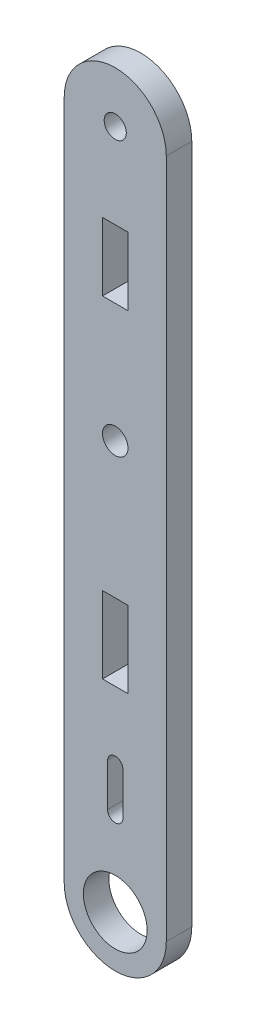
ISO-10303-21;
HEADER;
FILE_DESCRIPTION(('STEP AP214'),'2;1');
FILE_NAME('part.step','',(''),(''),'','','');
FILE_SCHEMA(('AUTOMOTIVE_DESIGN { 1 0 10303 214 1 1 1 1 }'));
ENDSEC;
DATA;
#1=APPLICATION_CONTEXT('core data for automotive mechanical design processes');
#2=APPLICATION_PROTOCOL_DEFINITION('international standard','automotive_design',2000,#1);
#3=PRODUCT_CONTEXT('',#1,'mechanical');
#4=PRODUCT('Part','Part','',(#3));
#5=PRODUCT_RELATED_PRODUCT_CATEGORY('part','',(#4));
#6=PRODUCT_DEFINITION_FORMATION('','',#4);
#7=PRODUCT_DEFINITION_CONTEXT('part definition',#1,'design');
#8=PRODUCT_DEFINITION('design','',#6,#7);
#9=PRODUCT_DEFINITION_SHAPE('','',#8);
#10=(LENGTH_UNIT() NAMED_UNIT(*) SI_UNIT(.MILLI.,.METRE.));
#11=(NAMED_UNIT(*) PLANE_ANGLE_UNIT() SI_UNIT($,.RADIAN.));
#12=(NAMED_UNIT(*) SI_UNIT($,.STERADIAN.) SOLID_ANGLE_UNIT());
#13=UNCERTAINTY_MEASURE_WITH_UNIT(LENGTH_MEASURE(1.E-05),#10,'distance_accuracy_value','');
#14=(GEOMETRIC_REPRESENTATION_CONTEXT(3) GLOBAL_UNCERTAINTY_ASSIGNED_CONTEXT((#13)) GLOBAL_UNIT_ASSIGNED_CONTEXT((#10,
#11,#12)) REPRESENTATION_CONTEXT('',''));
#15=CARTESIAN_POINT('',(0.,0.,0.));
#16=DIRECTION('',(0.,0.,1.));
#17=DIRECTION('',(1.,0.,0.));
#18=AXIS2_PLACEMENT_3D('',#15,#16,#17);
#19=CARTESIAN_POINT('',(62.0577599999999,76.1305837884342,3.));
#20=DIRECTION('',(0.,0.,1.));
#21=DIRECTION('',(1.,0.,0.));
#22=AXIS2_PLACEMENT_3D('',#19,#20,#21);
#23=PLANE('',#22);
#24=CARTESIAN_POINT('',(62.0577599980767,76.1305337867058,3.));
#25=DIRECTION('',(0.,0.,1.));
#26=DIRECTION('',(1.,0.,0.));
#27=AXIS2_PLACEMENT_3D('',#24,#25,#26);
#28=CIRCLE('',#27,1.30000000192317);
#29=CARTESIAN_POINT('',(63.3577599999999,76.1305337867058,3.));
#30=VERTEX_POINT('',#29);
#31=EDGE_CURVE('E250',#30,#30,#28,.T.);
#32=ORIENTED_EDGE('',*,*,#31,.F.);
#33=EDGE_LOOP('',(#32));
#34=FACE_BOUND('',#33,.T.);
#35=CARTESIAN_POINT('',(62.0577599999999,76.1305837884342,3.));
#36=DIRECTION('',(0.,0.,1.));
#37=DIRECTION('',(1.,0.,0.));
#38=AXIS2_PLACEMENT_3D('',#35,#36,#37);
#39=CIRCLE('',#38,6.00000000020827);
#40=CARTESIAN_POINT('',(68.0577599999999,76.1305337882123,3.));
#41=VERTEX_POINT('',#40);
#42=CARTESIAN_POINT('',(56.05776,76.1306337886561,3.));
#43=VERTEX_POINT('',#42);
#44=EDGE_CURVE('E262',#41,#43,#39,.T.);
#45=ORIENTED_EDGE('',*,*,#44,.T.);
#46=DIRECTION('',(0.,-1.,0.));
#47=VECTOR('',#46,1.);
#48=CARTESIAN_POINT('',(56.05776,-3.86946621138819,3.));
#49=LINE('',#48,#47);
#50=CARTESIAN_POINT('',(56.0577599993332,-3.86946621138819,3.));
#51=VERTEX_POINT('',#50);
#52=EDGE_CURVE('E265',#43,#51,#49,.T.);
#53=ORIENTED_EDGE('',*,*,#52,.T.);
#54=CARTESIAN_POINT('',(62.0577599993332,-3.86946621203773,3.));
#55=DIRECTION('',(0.,0.,1.));
#56=DIRECTION('',(1.,0.,0.));
#57=AXIS2_PLACEMENT_3D('',#54,#55,#56);
#58=CIRCLE('',#57,5.99999999999994);
#59=CARTESIAN_POINT('',(68.0577599999999,-3.8694662113882,3.));
#60=VERTEX_POINT('',#59);
#61=EDGE_CURVE('E268',#51,#60,#58,.T.);
#62=ORIENTED_EDGE('',*,*,#61,.T.);
#63=DIRECTION('',(0.,1.,0.));
#64=VECTOR('',#63,1.);
#65=CARTESIAN_POINT('',(68.0577599999999,76.1305337882123,3.));
#66=LINE('',#65,#64);
#67=EDGE_CURVE('E270',#60,#41,#66,.T.);
#68=ORIENTED_EDGE('',*,*,#67,.T.);
#69=EDGE_LOOP('',(#45,#53,#62,#68));
#70=FACE_BOUND('',#69,.T.);
#71=CARTESIAN_POINT('',(62.0577599993332,-3.86946621203773,3.));
#72=DIRECTION('',(0.,0.,1.));
#73=DIRECTION('',(1.,0.,0.));
#74=AXIS2_PLACEMENT_3D('',#71,#72,#73);
#75=CIRCLE('',#74,3.75000000066668);
#76=CARTESIAN_POINT('',(65.8077599999998,-3.86946621203773,3.));
#77=VERTEX_POINT('',#76);
#78=EDGE_CURVE('E256',#77,#77,#75,.T.);
#79=ORIENTED_EDGE('',*,*,#78,.F.);
#80=EDGE_LOOP('',(#79));
#81=FACE_BOUND('',#80,.T.);
#82=CARTESIAN_POINT('',(62.0577600016664,44.1306337869623,3.));
#83=DIRECTION('',(0.,0.,1.));
#84=DIRECTION('',(1.,0.,0.));
#85=AXIS2_PLACEMENT_3D('',#82,#83,#84);
#86=CIRCLE('',#85,1.50000000166677);
#87=CARTESIAN_POINT('',(63.5577600033331,44.1306337869623,3.));
#88=VERTEX_POINT('',#87);
#89=EDGE_CURVE('E244',#88,#88,#86,.T.);
#90=ORIENTED_EDGE('',*,*,#89,.F.);
#91=EDGE_LOOP('',(#90));
#92=FACE_BOUND('',#91,.T.);
#93=DIRECTION('',(0.,1.,0.));
#94=VECTOR('',#93,1.);
#95=CARTESIAN_POINT('',(62.9577599999999,6.1305337886308,3.));
#96=LINE('',#95,#94);
#97=CARTESIAN_POINT('',(62.9577599999999,6.1305337886308,3.));
#98=VERTEX_POINT('',#97);
#99=CARTESIAN_POINT('',(62.9577599999999,11.130533785851,3.));
#100=VERTEX_POINT('',#99);
#101=EDGE_CURVE('E215',#98,#100,#96,.T.);
#102=ORIENTED_EDGE('',*,*,#101,.F.);
#103=CARTESIAN_POINT('',(62.0577599999999,6.1305337886308,3.));
#104=DIRECTION('',(0.,0.,1.));
#105=DIRECTION('',(1.,0.,0.));
#106=AXIS2_PLACEMENT_3D('',#103,#104,#105);
#107=CIRCLE('',#106,0.899999999999946);
#108=CARTESIAN_POINT('',(61.15776,6.1305337886308,3.));
#109=VERTEX_POINT('',#108);
#110=EDGE_CURVE('E213',#109,#98,#107,.T.);
#111=ORIENTED_EDGE('',*,*,#110,.F.);
#112=DIRECTION('',(0.,-1.,0.));
#113=VECTOR('',#112,1.);
#114=CARTESIAN_POINT('',(61.15776,11.1306337886286,3.));
#115=LINE('',#114,#113);
#116=CARTESIAN_POINT('',(61.15776,11.1306337886286,3.));
#117=VERTEX_POINT('',#116);
#118=EDGE_CURVE('E221',#117,#109,#115,.T.);
#119=ORIENTED_EDGE('',*,*,#118,.F.);
#120=CARTESIAN_POINT('',(62.0577599999999,11.1305837872398,3.));
#121=DIRECTION('',(0.,0.,1.));
#122=DIRECTION('',(1.,0.,0.));
#123=AXIS2_PLACEMENT_3D('',#120,#121,#122);
#124=CIRCLE('',#123,0.900000001388912);
#125=EDGE_CURVE('E218',#100,#117,#124,.T.);
#126=ORIENTED_EDGE('',*,*,#125,.F.);
#127=EDGE_LOOP('',(#102,#111,#119,#126));
#128=FACE_BOUND('',#127,.T.);
#129=DIRECTION('',(0.,-1.,0.));
#130=VECTOR('',#129,1.);
#131=CARTESIAN_POINT('',(60.5577599999999,28.130533788629,3.));
#132=LINE('',#131,#130);
#133=CARTESIAN_POINT('',(60.5577599999999,28.130533788629,3.));
#134=VERTEX_POINT('',#133);
#135=CARTESIAN_POINT('',(60.5577599999999,19.130533788629,3.));
#136=VERTEX_POINT('',#135);
#137=EDGE_CURVE('E184',#134,#136,#132,.T.);
#138=ORIENTED_EDGE('',*,*,#137,.F.);
#139=DIRECTION('',(-1.,0.,0.));
#140=VECTOR('',#139,1.);
#141=CARTESIAN_POINT('',(60.5577599999999,28.130533788629,3.));
#142=LINE('',#141,#140);
#143=CARTESIAN_POINT('',(63.5577599999999,28.130533788629,3.));
#144=VERTEX_POINT('',#143);
#145=EDGE_CURVE('E182',#144,#134,#142,.T.);
#146=ORIENTED_EDGE('',*,*,#145,.F.);
#147=DIRECTION('',(0.,1.,0.));
#148=VECTOR('',#147,1.);
#149=CARTESIAN_POINT('',(63.5577599999999,28.130533788629,3.));
#150=LINE('',#149,#148);
#151=CARTESIAN_POINT('',(63.5577599999999,19.130533788629,3.));
#152=VERTEX_POINT('',#151);
#153=EDGE_CURVE('E190',#152,#144,#150,.T.);
#154=ORIENTED_EDGE('',*,*,#153,.F.);
#155=DIRECTION('',(1.,0.,0.));
#156=VECTOR('',#155,1.);
#157=CARTESIAN_POINT('',(63.5577599999999,19.130533788629,3.));
#158=LINE('',#157,#156);
#159=EDGE_CURVE('E187',#136,#152,#158,.T.);
#160=ORIENTED_EDGE('',*,*,#159,.F.);
#161=EDGE_LOOP('',(#138,#146,#154,#160));
#162=FACE_BOUND('',#161,.T.);
#163=DIRECTION('',(0.,-1.,0.));
#164=VECTOR('',#163,1.);
#165=CARTESIAN_POINT('',(60.5577599999999,66.130533788629,3.));
#166=LINE('',#165,#164);
#167=CARTESIAN_POINT('',(60.5577599999999,66.130533788629,3.));
#168=VERTEX_POINT('',#167);
#169=CARTESIAN_POINT('',(60.5577599999999,58.130533788629,3.));
#170=VERTEX_POINT('',#169);
#171=EDGE_CURVE('E154',#168,#170,#166,.T.);
#172=ORIENTED_EDGE('',*,*,#171,.F.);
#173=DIRECTION('',(-1.,0.,0.));
#174=VECTOR('',#173,1.);
#175=CARTESIAN_POINT('',(60.5577599999999,66.130533788629,3.));
#176=LINE('',#175,#174);
#177=CARTESIAN_POINT('',(63.5577599999999,66.130533788629,3.));
#178=VERTEX_POINT('',#177);
#179=EDGE_CURVE('E146',#178,#168,#176,.T.);
#180=ORIENTED_EDGE('',*,*,#179,.F.);
#181=DIRECTION('',(0.,1.,0.));
#182=VECTOR('',#181,1.);
#183=CARTESIAN_POINT('',(63.5577599999999,66.130533788629,3.));
#184=LINE('',#183,#182);
#185=CARTESIAN_POINT('',(63.5577599999999,58.130533788629,3.));
#186=VERTEX_POINT('',#185);
#187=EDGE_CURVE('E168',#186,#178,#184,.T.);
#188=ORIENTED_EDGE('',*,*,#187,.F.);
#189=DIRECTION('',(1.,0.,0.));
#190=VECTOR('',#189,1.);
#191=CARTESIAN_POINT('',(60.5577599999999,58.130533788629,3.));
#192=LINE('',#191,#190);
#193=EDGE_CURVE('E166',#170,#186,#192,.T.);
#194=ORIENTED_EDGE('',*,*,#193,.F.);
#195=EDGE_LOOP('',(#172,#180,#188,#194));
#196=FACE_BOUND('',#195,.T.);
#197=ADVANCED_FACE('F33',(#34,#70,#81,#92,#128,#162,#196),#23,.T.);
#198=CARTESIAN_POINT('',(62.0577599999999,76.1305837884342,0.));
#199=DIRECTION('',(0.,0.,1.));
#200=DIRECTION('',(1.,0.,0.));
#201=AXIS2_PLACEMENT_3D('',#198,#199,#200);
#202=PLANE('',#201);
#203=DIRECTION('',(-1.,0.,0.));
#204=VECTOR('',#203,1.);
#205=CARTESIAN_POINT('',(60.5577599999999,28.130533788629,0.));
#206=LINE('',#205,#204);
#207=CARTESIAN_POINT('',(63.5577599999999,28.130533788629,0.));
#208=VERTEX_POINT('',#207);
#209=CARTESIAN_POINT('',(60.5577599999999,28.130533788629,0.));
#210=VERTEX_POINT('',#209);
#211=EDGE_CURVE('E162',#208,#210,#206,.T.);
#212=ORIENTED_EDGE('',*,*,#211,.T.);
#213=DIRECTION('',(0.,-1.,0.));
#214=VECTOR('',#213,1.);
#215=CARTESIAN_POINT('',(60.5577599999999,28.130533788629,0.));
#216=LINE('',#215,#214);
#217=CARTESIAN_POINT('',(60.5577599999999,19.130533788629,0.));
#218=VERTEX_POINT('',#217);
#219=EDGE_CURVE('E195',#210,#218,#216,.T.);
#220=ORIENTED_EDGE('',*,*,#219,.T.);
#221=DIRECTION('',(1.,0.,0.));
#222=VECTOR('',#221,1.);
#223=CARTESIAN_POINT('',(63.5577599999999,19.130533788629,0.));
#224=LINE('',#223,#222);
#225=CARTESIAN_POINT('',(63.5577599999999,19.130533788629,0.));
#226=VERTEX_POINT('',#225);
#227=EDGE_CURVE('E198',#218,#226,#224,.T.);
#228=ORIENTED_EDGE('',*,*,#227,.T.);
#229=DIRECTION('',(0.,1.,0.));
#230=VECTOR('',#229,1.);
#231=CARTESIAN_POINT('',(63.5577599999999,28.130533788629,0.));
#232=LINE('',#231,#230);
#233=EDGE_CURVE('E185',#226,#208,#232,.T.);
#234=ORIENTED_EDGE('',*,*,#233,.T.);
#235=EDGE_LOOP('',(#212,#220,#228,#234));
#236=FACE_BOUND('',#235,.T.);
#237=CARTESIAN_POINT('',(62.0577600016664,44.1306337869623,0.));
#238=DIRECTION('',(0.,0.,1.));
#239=DIRECTION('',(1.,0.,0.));
#240=AXIS2_PLACEMENT_3D('',#237,#238,#239);
#241=CIRCLE('',#240,1.50000000166677);
#242=CARTESIAN_POINT('',(63.5577600033331,44.1306337869623,0.));
#243=VERTEX_POINT('',#242);
#244=EDGE_CURVE('E243',#243,#243,#241,.T.);
#245=ORIENTED_EDGE('',*,*,#244,.T.);
#246=EDGE_LOOP('',(#245));
#247=FACE_BOUND('',#246,.T.);
#248=CARTESIAN_POINT('',(62.0577599980767,76.1305337867058,0.));
#249=DIRECTION('',(0.,0.,1.));
#250=DIRECTION('',(1.,0.,0.));
#251=AXIS2_PLACEMENT_3D('',#248,#249,#250);
#252=CIRCLE('',#251,1.30000000192317);
#253=CARTESIAN_POINT('',(63.3577599999999,76.1305337867058,0.));
#254=VERTEX_POINT('',#253);
#255=EDGE_CURVE('E247',#254,#254,#252,.T.);
#256=ORIENTED_EDGE('',*,*,#255,.T.);
#257=EDGE_LOOP('',(#256));
#258=FACE_BOUND('',#257,.T.);
#259=CARTESIAN_POINT('',(62.0577599993332,-3.86946621203773,0.));
#260=DIRECTION('',(0.,0.,1.));
#261=DIRECTION('',(1.,0.,0.));
#262=AXIS2_PLACEMENT_3D('',#259,#260,#261);
#263=CIRCLE('',#262,3.75000000066668);
#264=CARTESIAN_POINT('',(65.8077599999998,-3.86946621203773,0.));
#265=VERTEX_POINT('',#264);
#266=EDGE_CURVE('E253',#265,#265,#263,.T.);
#267=ORIENTED_EDGE('',*,*,#266,.T.);
#268=EDGE_LOOP('',(#267));
#269=FACE_BOUND('',#268,.T.);
#270=CARTESIAN_POINT('',(62.0577599999999,76.1305837884342,0.));
#271=DIRECTION('',(0.,0.,1.));
#272=DIRECTION('',(1.,0.,0.));
#273=AXIS2_PLACEMENT_3D('',#270,#271,#272);
#274=CIRCLE('',#273,6.00000000020827);
#275=CARTESIAN_POINT('',(68.0577599999999,76.1305337882123,0.));
#276=VERTEX_POINT('',#275);
#277=CARTESIAN_POINT('',(56.05776,76.1306337886561,0.));
#278=VERTEX_POINT('',#277);
#279=EDGE_CURVE('E259',#276,#278,#274,.T.);
#280=ORIENTED_EDGE('',*,*,#279,.F.);
#281=DIRECTION('',(0.,1.,0.));
#282=VECTOR('',#281,1.);
#283=CARTESIAN_POINT('',(68.0577599999999,76.1305337882123,0.));
#284=LINE('',#283,#282);
#285=CARTESIAN_POINT('',(68.0577599999999,-3.8694662113882,0.));
#286=VERTEX_POINT('',#285);
#287=EDGE_CURVE('E266',#286,#276,#284,.T.);
#288=ORIENTED_EDGE('',*,*,#287,.F.);
#289=CARTESIAN_POINT('',(62.0577599993332,-3.86946621203773,0.));
#290=DIRECTION('',(0.,0.,1.));
#291=DIRECTION('',(1.,0.,0.));
#292=AXIS2_PLACEMENT_3D('',#289,#290,#291);
#293=CIRCLE('',#292,5.99999999999994);
#294=CARTESIAN_POINT('',(56.0577599993332,-3.86946621138819,0.));
#295=VERTEX_POINT('',#294);
#296=EDGE_CURVE('E277',#295,#286,#293,.T.);
#297=ORIENTED_EDGE('',*,*,#296,.F.);
#298=DIRECTION('',(0.,-1.,0.));
#299=VECTOR('',#298,1.);
#300=CARTESIAN_POINT('',(56.05776,-3.86946621138819,0.));
#301=LINE('',#300,#299);
#302=EDGE_CURVE('E275',#278,#295,#301,.T.);
#303=ORIENTED_EDGE('',*,*,#302,.F.);
#304=EDGE_LOOP('',(#280,#288,#297,#303));
#305=FACE_BOUND('',#304,.T.);
#306=CARTESIAN_POINT('',(62.0577599999999,6.1305337886308,0.));
#307=DIRECTION('',(0.,0.,1.));
#308=DIRECTION('',(1.,0.,0.));
#309=AXIS2_PLACEMENT_3D('',#306,#307,#308);
#310=CIRCLE('',#309,0.899999999999946);
#311=CARTESIAN_POINT('',(61.15776,6.13053378863081,0.));
#312=VERTEX_POINT('',#311);
#313=CARTESIAN_POINT('',(62.9577599999999,6.1305337886308,0.));
#314=VERTEX_POINT('',#313);
#315=EDGE_CURVE('E212',#312,#314,#310,.T.);
#316=ORIENTED_EDGE('',*,*,#315,.T.);
#317=DIRECTION('',(0.,1.,0.));
#318=VECTOR('',#317,1.);
#319=CARTESIAN_POINT('',(62.9577599999999,6.1305337886308,0.));
#320=LINE('',#319,#318);
#321=CARTESIAN_POINT('',(62.9577599999999,11.130533785851,0.));
#322=VERTEX_POINT('',#321);
#323=EDGE_CURVE('E226',#314,#322,#320,.T.);
#324=ORIENTED_EDGE('',*,*,#323,.T.);
#325=CARTESIAN_POINT('',(62.0577599999999,11.1305837872398,0.));
#326=DIRECTION('',(0.,0.,1.));
#327=DIRECTION('',(1.,0.,0.));
#328=AXIS2_PLACEMENT_3D('',#325,#326,#327);
#329=CIRCLE('',#328,0.900000001388912);
#330=CARTESIAN_POINT('',(61.15776,11.1306337886286,0.));
#331=VERTEX_POINT('',#330);
#332=EDGE_CURVE('E229',#322,#331,#329,.T.);
#333=ORIENTED_EDGE('',*,*,#332,.T.);
#334=DIRECTION('',(0.,-1.,0.));
#335=VECTOR('',#334,1.);
#336=CARTESIAN_POINT('',(61.15776,11.1306337886286,0.));
#337=LINE('',#336,#335);
#338=EDGE_CURVE('E216',#331,#312,#337,.T.);
#339=ORIENTED_EDGE('',*,*,#338,.T.);
#340=EDGE_LOOP('',(#316,#324,#333,#339));
#341=FACE_BOUND('',#340,.T.);
#342=DIRECTION('',(-1.,0.,0.));
#343=VECTOR('',#342,1.);
#344=CARTESIAN_POINT('',(60.5577599999999,66.130533788629,0.));
#345=LINE('',#344,#343);
#346=CARTESIAN_POINT('',(63.5577599999999,66.130533788629,0.));
#347=VERTEX_POINT('',#346);
#348=CARTESIAN_POINT('',(60.5577599999999,66.130533788629,0.));
#349=VERTEX_POINT('',#348);
#350=EDGE_CURVE('E56',#347,#349,#345,.T.);
#351=ORIENTED_EDGE('',*,*,#350,.T.);
#352=DIRECTION('',(0.,-1.,0.));
#353=VECTOR('',#352,1.);
#354=CARTESIAN_POINT('',(60.5577599999999,66.130533788629,0.));
#355=LINE('',#354,#353);
#356=CARTESIAN_POINT('',(60.5577599999999,58.130533788629,0.));
#357=VERTEX_POINT('',#356);
#358=EDGE_CURVE('E161',#349,#357,#355,.T.);
#359=ORIENTED_EDGE('',*,*,#358,.T.);
#360=DIRECTION('',(1.,0.,0.));
#361=VECTOR('',#360,1.);
#362=CARTESIAN_POINT('',(60.5577599999999,58.130533788629,0.));
#363=LINE('',#362,#361);
#364=CARTESIAN_POINT('',(63.5577599999999,58.130533788629,0.));
#365=VERTEX_POINT('',#364);
#366=EDGE_CURVE('E174',#357,#365,#363,.T.);
#367=ORIENTED_EDGE('',*,*,#366,.T.);
#368=DIRECTION('',(0.,1.,0.));
#369=VECTOR('',#368,1.);
#370=CARTESIAN_POINT('',(63.5577599999999,66.130533788629,0.));
#371=LINE('',#370,#369);
#372=EDGE_CURVE('E155',#365,#347,#371,.T.);
#373=ORIENTED_EDGE('',*,*,#372,.T.);
#374=EDGE_LOOP('',(#351,#359,#367,#373));
#375=FACE_BOUND('',#374,.T.);
#376=ADVANCED_FACE('F295',(#236,#247,#258,#269,#305,#341,#375),#202,.F.);
#377=CARTESIAN_POINT('',(62.0577599999999,76.1305837884342,3.));
#378=DIRECTION('',(0.,0.,-1.));
#379=DIRECTION('',(-1.,0.,0.));
#380=AXIS2_PLACEMENT_3D('',#377,#378,#379);
#381=CYLINDRICAL_SURFACE('',#380,6.00000000020827);
#382=ORIENTED_EDGE('',*,*,#279,.T.);
#383=DIRECTION('',(0.,0.,-1.));
#384=VECTOR('',#383,1.);
#385=CARTESIAN_POINT('',(56.05776,76.1306337886561,3.));
#386=LINE('',#385,#384);
#387=EDGE_CURVE('E11',#43,#278,#386,.T.);
#388=ORIENTED_EDGE('',*,*,#387,.F.);
#389=ORIENTED_EDGE('',*,*,#44,.F.);
#390=DIRECTION('',(0.,0.,-1.));
#391=VECTOR('',#390,1.);
#392=CARTESIAN_POINT('',(68.0577599999999,76.1305337882123,3.));
#393=LINE('',#392,#391);
#394=EDGE_CURVE('E272',#41,#276,#393,.T.);
#395=ORIENTED_EDGE('',*,*,#394,.T.);
#396=EDGE_LOOP('',(#382,#388,#389,#395));
#397=FACE_BOUND('',#396,.T.);
#398=ADVANCED_FACE('F35',(#397),#381,.T.);
#399=CARTESIAN_POINT('',(56.05776,-3.86946621138819,3.));
#400=DIRECTION('',(1.,0.,0.));
#401=DIRECTION('',(0.,0.,-1.));
#402=AXIS2_PLACEMENT_3D('',#399,#400,#401);
#403=PLANE('',#402);
#404=ORIENTED_EDGE('',*,*,#302,.T.);
#405=DIRECTION('',(0.,0.,-1.));
#406=VECTOR('',#405,1.);
#407=CARTESIAN_POINT('',(56.0577599993332,-3.86946621138819,3.));
#408=LINE('',#407,#406);
#409=EDGE_CURVE('E41',#51,#295,#408,.T.);
#410=ORIENTED_EDGE('',*,*,#409,.F.);
#411=ORIENTED_EDGE('',*,*,#52,.F.);
#412=ORIENTED_EDGE('',*,*,#387,.T.);
#413=EDGE_LOOP('',(#404,#410,#411,#412));
#414=FACE_BOUND('',#413,.T.);
#415=ADVANCED_FACE('F306',(#414),#403,.F.);
#416=CARTESIAN_POINT('',(62.0577599993332,-3.86946621203773,3.));
#417=DIRECTION('',(0.,0.,-1.));
#418=DIRECTION('',(-1.,0.,0.));
#419=AXIS2_PLACEMENT_3D('',#416,#417,#418);
#420=CYLINDRICAL_SURFACE('',#419,5.99999999999994);
#421=ORIENTED_EDGE('',*,*,#296,.T.);
#422=DIRECTION('',(0.,0.,-1.));
#423=VECTOR('',#422,1.);
#424=CARTESIAN_POINT('',(68.0577599999999,-3.8694662113882,3.));
#425=LINE('',#424,#423);
#426=EDGE_CURVE('E282',#60,#286,#425,.T.);
#427=ORIENTED_EDGE('',*,*,#426,.F.);
#428=ORIENTED_EDGE('',*,*,#61,.F.);
#429=ORIENTED_EDGE('',*,*,#409,.T.);
#430=EDGE_LOOP('',(#421,#427,#428,#429));
#431=FACE_BOUND('',#430,.T.);
#432=ADVANCED_FACE('F289',(#431),#420,.T.);
#433=CARTESIAN_POINT('',(68.0577599999999,76.1305337882123,3.));
#434=DIRECTION('',(-1.,0.,0.));
#435=DIRECTION('',(0.,0.,1.));
#436=AXIS2_PLACEMENT_3D('',#433,#434,#435);
#437=PLANE('',#436);
#438=ORIENTED_EDGE('',*,*,#287,.T.);
#439=ORIENTED_EDGE('',*,*,#394,.F.);
#440=ORIENTED_EDGE('',*,*,#67,.F.);
#441=ORIENTED_EDGE('',*,*,#426,.T.);
#442=EDGE_LOOP('',(#438,#439,#440,#441));
#443=FACE_BOUND('',#442,.T.);
#444=ADVANCED_FACE('F299',(#443),#437,.F.);
#445=CARTESIAN_POINT('',(62.0577599993332,-3.86946621203773,3.));
#446=DIRECTION('',(0.,0.,-1.));
#447=DIRECTION('',(-1.,0.,0.));
#448=AXIS2_PLACEMENT_3D('',#445,#446,#447);
#449=CYLINDRICAL_SURFACE('',#448,3.75000000066668);
#450=ORIENTED_EDGE('',*,*,#78,.T.);
#451=EDGE_LOOP('',(#450));
#452=FACE_BOUND('',#451,.T.);
#453=ORIENTED_EDGE('',*,*,#266,.F.);
#454=EDGE_LOOP('',(#453));
#455=FACE_BOUND('',#454,.T.);
#456=ADVANCED_FACE('F323',(#452,#455),#449,.F.);
#457=CARTESIAN_POINT('',(62.0577599980767,76.1305337867058,3.));
#458=DIRECTION('',(0.,0.,-1.));
#459=DIRECTION('',(-1.,0.,0.));
#460=AXIS2_PLACEMENT_3D('',#457,#458,#459);
#461=CYLINDRICAL_SURFACE('',#460,1.30000000192317);
#462=ORIENTED_EDGE('',*,*,#31,.T.);
#463=EDGE_LOOP('',(#462));
#464=FACE_BOUND('',#463,.T.);
#465=ORIENTED_EDGE('',*,*,#255,.F.);
#466=EDGE_LOOP('',(#465));
#467=FACE_BOUND('',#466,.T.);
#468=ADVANCED_FACE('F330',(#464,#467),#461,.F.);
#469=CARTESIAN_POINT('',(62.0577600016664,44.1306337869623,3.));
#470=DIRECTION('',(0.,0.,-1.));
#471=DIRECTION('',(-1.,0.,0.));
#472=AXIS2_PLACEMENT_3D('',#469,#470,#471);
#473=CYLINDRICAL_SURFACE('',#472,1.50000000166677);
#474=ORIENTED_EDGE('',*,*,#89,.T.);
#475=EDGE_LOOP('',(#474));
#476=FACE_BOUND('',#475,.T.);
#477=ORIENTED_EDGE('',*,*,#244,.F.);
#478=EDGE_LOOP('',(#477));
#479=FACE_BOUND('',#478,.T.);
#480=ADVANCED_FACE('F335',(#476,#479),#473,.F.);
#481=CARTESIAN_POINT('',(62.0577599999999,6.1305337886308,3.));
#482=DIRECTION('',(0.,0.,-1.));
#483=DIRECTION('',(-1.,0.,0.));
#484=AXIS2_PLACEMENT_3D('',#481,#482,#483);
#485=CYLINDRICAL_SURFACE('',#484,0.899999999999946);
#486=ORIENTED_EDGE('',*,*,#315,.F.);
#487=DIRECTION('',(0.,0.,-1.));
#488=VECTOR('',#487,1.);
#489=CARTESIAN_POINT('',(61.15776,6.1305337886308,3.));
#490=LINE('',#489,#488);
#491=EDGE_CURVE('E223',#109,#312,#490,.T.);
#492=ORIENTED_EDGE('',*,*,#491,.F.);
#493=ORIENTED_EDGE('',*,*,#110,.T.);
#494=DIRECTION('',(0.,0.,-1.));
#495=VECTOR('',#494,1.);
#496=CARTESIAN_POINT('',(62.9577599999999,6.1305337886308,3.));
#497=LINE('',#496,#495);
#498=EDGE_CURVE('E240',#98,#314,#497,.T.);
#499=ORIENTED_EDGE('',*,*,#498,.T.);
#500=EDGE_LOOP('',(#486,#492,#493,#499));
#501=FACE_BOUND('',#500,.T.);
#502=ADVANCED_FACE('F391',(#501),#485,.F.);
#503=CARTESIAN_POINT('',(62.9577599999999,6.1305337886308,3.));
#504=DIRECTION('',(-1.,0.,0.));
#505=DIRECTION('',(0.,0.,1.));
#506=AXIS2_PLACEMENT_3D('',#503,#504,#505);
#507=PLANE('',#506);
#508=ORIENTED_EDGE('',*,*,#323,.F.);
#509=ORIENTED_EDGE('',*,*,#498,.F.);
#510=ORIENTED_EDGE('',*,*,#101,.T.);
#511=DIRECTION('',(0.,0.,-1.));
#512=VECTOR('',#511,1.);
#513=CARTESIAN_POINT('',(62.9577599999999,11.130533785851,3.));
#514=LINE('',#513,#512);
#515=EDGE_CURVE('E238',#100,#322,#514,.T.);
#516=ORIENTED_EDGE('',*,*,#515,.T.);
#517=EDGE_LOOP('',(#508,#509,#510,#516));
#518=FACE_BOUND('',#517,.T.);
#519=ADVANCED_FACE('F387',(#518),#507,.T.);
#520=CARTESIAN_POINT('',(62.0577599999999,11.1305837872398,3.));
#521=DIRECTION('',(0.,0.,-1.));
#522=DIRECTION('',(-1.,0.,0.));
#523=AXIS2_PLACEMENT_3D('',#520,#521,#522);
#524=CYLINDRICAL_SURFACE('',#523,0.900000001388912);
#525=ORIENTED_EDGE('',*,*,#332,.F.);
#526=ORIENTED_EDGE('',*,*,#515,.F.);
#527=ORIENTED_EDGE('',*,*,#125,.T.);
#528=DIRECTION('',(0.,0.,-1.));
#529=VECTOR('',#528,1.);
#530=CARTESIAN_POINT('',(61.15776,11.1306337886286,3.));
#531=LINE('',#530,#529);
#532=EDGE_CURVE('E236',#117,#331,#531,.T.);
#533=ORIENTED_EDGE('',*,*,#532,.T.);
#534=EDGE_LOOP('',(#525,#526,#527,#533));
#535=FACE_BOUND('',#534,.T.);
#536=ADVANCED_FACE('F383',(#535),#524,.F.);
#537=CARTESIAN_POINT('',(61.15776,11.1306337886286,3.));
#538=DIRECTION('',(1.,0.,0.));
#539=DIRECTION('',(0.,0.,-1.));
#540=AXIS2_PLACEMENT_3D('',#537,#538,#539);
#541=PLANE('',#540);
#542=ORIENTED_EDGE('',*,*,#338,.F.);
#543=ORIENTED_EDGE('',*,*,#532,.F.);
#544=ORIENTED_EDGE('',*,*,#118,.T.);
#545=ORIENTED_EDGE('',*,*,#491,.T.);
#546=EDGE_LOOP('',(#542,#543,#544,#545));
#547=FACE_BOUND('',#546,.T.);
#548=ADVANCED_FACE('F380',(#547),#541,.T.);
#549=CARTESIAN_POINT('',(60.5577599999999,28.130533788629,3.));
#550=DIRECTION('',(0.,-1.,0.));
#551=DIRECTION('',(1.,0.,0.));
#552=AXIS2_PLACEMENT_3D('',#549,#550,#551);
#553=PLANE('',#552);
#554=ORIENTED_EDGE('',*,*,#211,.F.);
#555=DIRECTION('',(0.,0.,-1.));
#556=VECTOR('',#555,1.);
#557=CARTESIAN_POINT('',(63.5577599999999,28.130533788629,3.));
#558=LINE('',#557,#556);
#559=EDGE_CURVE('E192',#144,#208,#558,.T.);
#560=ORIENTED_EDGE('',*,*,#559,.F.);
#561=ORIENTED_EDGE('',*,*,#145,.T.);
#562=DIRECTION('',(0.,0.,-1.));
#563=VECTOR('',#562,1.);
#564=CARTESIAN_POINT('',(60.5577599999999,28.130533788629,3.));
#565=LINE('',#564,#563);
#566=EDGE_CURVE('E209',#134,#210,#565,.T.);
#567=ORIENTED_EDGE('',*,*,#566,.T.);
#568=EDGE_LOOP('',(#554,#560,#561,#567));
#569=FACE_BOUND('',#568,.T.);
#570=ADVANCED_FACE('F362',(#569),#553,.T.);
#571=CARTESIAN_POINT('',(60.5577599999999,28.130533788629,3.));
#572=DIRECTION('',(1.,0.,0.));
#573=DIRECTION('',(0.,0.,-1.));
#574=AXIS2_PLACEMENT_3D('',#571,#572,#573);
#575=PLANE('',#574);
#576=ORIENTED_EDGE('',*,*,#219,.F.);
#577=ORIENTED_EDGE('',*,*,#566,.F.);
#578=ORIENTED_EDGE('',*,*,#137,.T.);
#579=DIRECTION('',(0.,0.,-1.));
#580=VECTOR('',#579,1.);
#581=CARTESIAN_POINT('',(60.5577599999999,19.130533788629,3.));
#582=LINE('',#581,#580);
#583=EDGE_CURVE('E207',#136,#218,#582,.T.);
#584=ORIENTED_EDGE('',*,*,#583,.T.);
#585=EDGE_LOOP('',(#576,#577,#578,#584));
#586=FACE_BOUND('',#585,.T.);
#587=ADVANCED_FACE('F355',(#586),#575,.T.);
#588=CARTESIAN_POINT('',(63.5577599999999,19.130533788629,3.));
#589=DIRECTION('',(0.,1.,0.));
#590=DIRECTION('',(-1.,0.,0.));
#591=AXIS2_PLACEMENT_3D('',#588,#589,#590);
#592=PLANE('',#591);
#593=ORIENTED_EDGE('',*,*,#227,.F.);
#594=ORIENTED_EDGE('',*,*,#583,.F.);
#595=ORIENTED_EDGE('',*,*,#159,.T.);
#596=DIRECTION('',(0.,0.,-1.));
#597=VECTOR('',#596,1.);
#598=CARTESIAN_POINT('',(63.5577599999999,19.130533788629,3.));
#599=LINE('',#598,#597);
#600=EDGE_CURVE('E205',#152,#226,#599,.T.);
#601=ORIENTED_EDGE('',*,*,#600,.T.);
#602=EDGE_LOOP('',(#593,#594,#595,#601));
#603=FACE_BOUND('',#602,.T.);
#604=ADVANCED_FACE('F358',(#603),#592,.T.);
#605=CARTESIAN_POINT('',(63.5577599999999,28.130533788629,3.));
#606=DIRECTION('',(-1.,0.,0.));
#607=DIRECTION('',(0.,0.,1.));
#608=AXIS2_PLACEMENT_3D('',#605,#606,#607);
#609=PLANE('',#608);
#610=ORIENTED_EDGE('',*,*,#233,.F.);
#611=ORIENTED_EDGE('',*,*,#600,.F.);
#612=ORIENTED_EDGE('',*,*,#153,.T.);
#613=ORIENTED_EDGE('',*,*,#559,.T.);
#614=EDGE_LOOP('',(#610,#611,#612,#613));
#615=FACE_BOUND('',#614,.T.);
#616=ADVANCED_FACE('F365',(#615),#609,.T.);
#617=CARTESIAN_POINT('',(60.5577599999999,66.130533788629,3.));
#618=DIRECTION('',(0.,-1.,0.));
#619=DIRECTION('',(0.,0.,-1.));
#620=AXIS2_PLACEMENT_3D('',#617,#618,#619);
#621=PLANE('',#620);
#622=ORIENTED_EDGE('',*,*,#350,.F.);
#623=DIRECTION('',(0.,0.,-1.));
#624=VECTOR('',#623,1.);
#625=CARTESIAN_POINT('',(63.5577599999999,66.130533788629,3.));
#626=LINE('',#625,#624);
#627=EDGE_CURVE('E150',#178,#347,#626,.T.);
#628=ORIENTED_EDGE('',*,*,#627,.F.);
#629=ORIENTED_EDGE('',*,*,#179,.T.);
#630=DIRECTION('',(0.,0.,-1.));
#631=VECTOR('',#630,1.);
#632=CARTESIAN_POINT('',(60.5577599999999,66.130533788629,3.));
#633=LINE('',#632,#631);
#634=EDGE_CURVE('E149',#168,#349,#633,.T.);
#635=ORIENTED_EDGE('',*,*,#634,.T.);
#636=EDGE_LOOP('',(#622,#628,#629,#635));
#637=FACE_BOUND('',#636,.T.);
#638=ADVANCED_FACE('F148',(#637),#621,.T.);
#639=CARTESIAN_POINT('',(60.5577599999999,66.130533788629,3.));
#640=DIRECTION('',(1.,0.,0.));
#641=DIRECTION('',(0.,0.,-1.));
#642=AXIS2_PLACEMENT_3D('',#639,#640,#641);
#643=PLANE('',#642);
#644=ORIENTED_EDGE('',*,*,#358,.F.);
#645=ORIENTED_EDGE('',*,*,#634,.F.);
#646=ORIENTED_EDGE('',*,*,#171,.T.);
#647=DIRECTION('',(0.,0.,-1.));
#648=VECTOR('',#647,1.);
#649=CARTESIAN_POINT('',(60.5577599999999,58.130533788629,3.));
#650=LINE('',#649,#648);
#651=EDGE_CURVE('E163',#170,#357,#650,.T.);
#652=ORIENTED_EDGE('',*,*,#651,.T.);
#653=EDGE_LOOP('',(#644,#645,#646,#652));
#654=FACE_BOUND('',#653,.T.);
#655=ADVANCED_FACE('F158',(#654),#643,.T.);
#656=CARTESIAN_POINT('',(60.5577599999999,58.130533788629,3.));
#657=DIRECTION('',(0.,1.,0.));
#658=DIRECTION('',(0.,0.,1.));
#659=AXIS2_PLACEMENT_3D('',#656,#657,#658);
#660=PLANE('',#659);
#661=ORIENTED_EDGE('',*,*,#366,.F.);
#662=ORIENTED_EDGE('',*,*,#651,.F.);
#663=ORIENTED_EDGE('',*,*,#193,.T.);
#664=DIRECTION('',(0.,0.,-1.));
#665=VECTOR('',#664,1.);
#666=CARTESIAN_POINT('',(63.5577599999999,58.130533788629,3.));
#667=LINE('',#666,#665);
#668=EDGE_CURVE('E48',#186,#365,#667,.T.);
#669=ORIENTED_EDGE('',*,*,#668,.T.);
#670=EDGE_LOOP('',(#661,#662,#663,#669));
#671=FACE_BOUND('',#670,.T.);
#672=ADVANCED_FACE('F454',(#671),#660,.T.);
#673=CARTESIAN_POINT('',(63.5577599999999,66.130533788629,3.));
#674=DIRECTION('',(-1.,0.,0.));
#675=DIRECTION('',(0.,0.,1.));
#676=AXIS2_PLACEMENT_3D('',#673,#674,#675);
#677=PLANE('',#676);
#678=ORIENTED_EDGE('',*,*,#372,.F.);
#679=ORIENTED_EDGE('',*,*,#668,.F.);
#680=ORIENTED_EDGE('',*,*,#187,.T.);
#681=ORIENTED_EDGE('',*,*,#627,.T.);
#682=EDGE_LOOP('',(#678,#679,#680,#681));
#683=FACE_BOUND('',#682,.T.);
#684=ADVANCED_FACE('F462',(#683),#677,.T.);
#685=CLOSED_SHELL('',(#197,#376,#398,#415,#432,#444,#456,#468,#480,#502,#519,#536,#548,#570,
#587,#604,#616,#638,#655,#672,#684));
#686=MANIFOLD_SOLID_BREP('B2',#685);
#687=ADVANCED_BREP_SHAPE_REPRESENTATION('',(#18,#686),#14);
#688=SHAPE_DEFINITION_REPRESENTATION(#9,#687);
ENDSEC;
END-ISO-10303-21;
